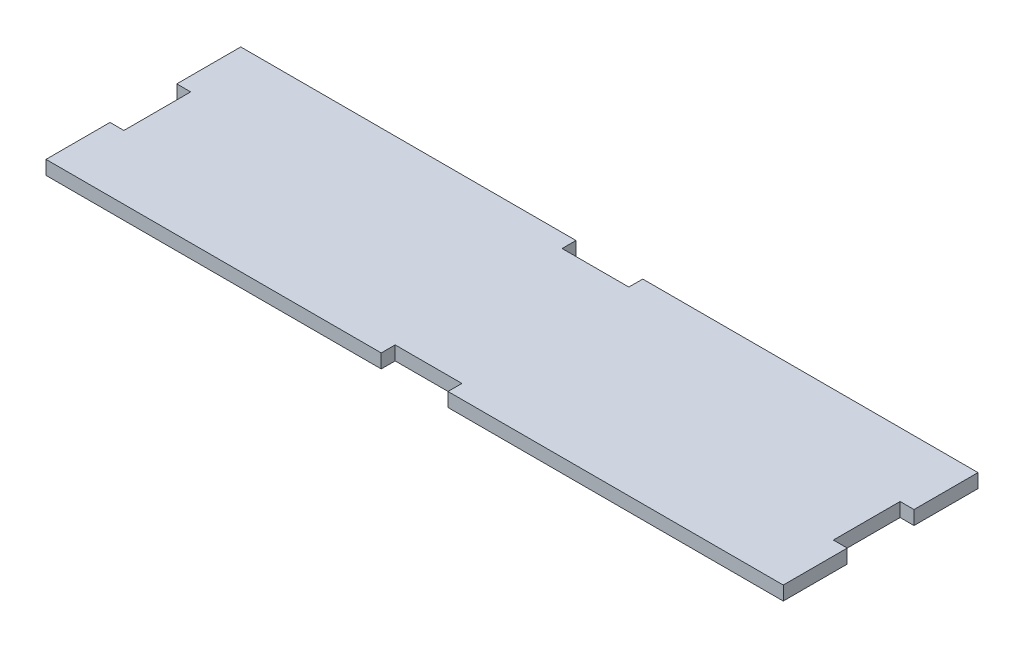
ISO-10303-21;
HEADER;
FILE_DESCRIPTION(('STEP AP214'),'2;1');
FILE_NAME('part.step','',(''),(''),'','','');
FILE_SCHEMA(('AUTOMOTIVE_DESIGN { 1 0 10303 214 1 1 1 1 }'));
ENDSEC;
DATA;
#1=APPLICATION_CONTEXT('core data for automotive mechanical design processes');
#2=APPLICATION_PROTOCOL_DEFINITION('international standard','automotive_design',2000,#1);
#3=PRODUCT_CONTEXT('',#1,'mechanical');
#4=PRODUCT('Part','Part','',(#3));
#5=PRODUCT_RELATED_PRODUCT_CATEGORY('part','',(#4));
#6=PRODUCT_DEFINITION_FORMATION('','',#4);
#7=PRODUCT_DEFINITION_CONTEXT('part definition',#1,'design');
#8=PRODUCT_DEFINITION('design','',#6,#7);
#9=PRODUCT_DEFINITION_SHAPE('','',#8);
#10=(LENGTH_UNIT() NAMED_UNIT(*) SI_UNIT(.MILLI.,.METRE.));
#11=(NAMED_UNIT(*) PLANE_ANGLE_UNIT() SI_UNIT($,.RADIAN.));
#12=(NAMED_UNIT(*) SI_UNIT($,.STERADIAN.) SOLID_ANGLE_UNIT());
#13=UNCERTAINTY_MEASURE_WITH_UNIT(LENGTH_MEASURE(1.E-05),#10,'distance_accuracy_value','');
#14=(GEOMETRIC_REPRESENTATION_CONTEXT(3) GLOBAL_UNCERTAINTY_ASSIGNED_CONTEXT((#13)) GLOBAL_UNIT_ASSIGNED_CONTEXT((#10,
#11,#12)) REPRESENTATION_CONTEXT('',''));
#15=CARTESIAN_POINT('',(0.,0.,0.));
#16=DIRECTION('',(0.,0.,1.));
#17=DIRECTION('',(1.,0.,0.));
#18=AXIS2_PLACEMENT_3D('',#15,#16,#17);
#19=CARTESIAN_POINT('',(0.,6.35,0.));
#20=DIRECTION('',(-1.,0.,0.));
#21=DIRECTION('',(0.,0.,1.));
#22=AXIS2_PLACEMENT_3D('',#19,#20,#21);
#23=PLANE('',#22);
#24=DIRECTION('',(0.,0.,-1.));
#25=VECTOR('',#24,1.);
#26=CARTESIAN_POINT('',(0.,0.,0.));
#27=LINE('',#26,#25);
#28=CARTESIAN_POINT('',(0.,0.,88.9));
#29=VERTEX_POINT('',#28);
#30=CARTESIAN_POINT('',(0.,0.,59.69));
#31=VERTEX_POINT('',#30);
#32=EDGE_CURVE('E350',#29,#31,#27,.T.);
#33=ORIENTED_EDGE('',*,*,#32,.T.);
#34=DIRECTION('',(0.,1.,0.));
#35=VECTOR('',#34,1.);
#36=CARTESIAN_POINT('',(0.,0.,59.69));
#37=LINE('',#36,#35);
#38=CARTESIAN_POINT('',(0.,6.35,59.69));
#39=VERTEX_POINT('',#38);
#40=EDGE_CURVE('E240',#31,#39,#37,.T.);
#41=ORIENTED_EDGE('',*,*,#40,.T.);
#42=DIRECTION('',(0.,0.,-1.));
#43=VECTOR('',#42,1.);
#44=CARTESIAN_POINT('',(0.,6.35,0.));
#45=LINE('',#44,#43);
#46=CARTESIAN_POINT('',(0.,6.35,88.9));
#47=VERTEX_POINT('',#46);
#48=EDGE_CURVE('E329',#47,#39,#45,.T.);
#49=ORIENTED_EDGE('',*,*,#48,.F.);
#50=DIRECTION('',(0.,-1.,0.));
#51=VECTOR('',#50,1.);
#52=CARTESIAN_POINT('',(0.,6.35,88.9));
#53=LINE('',#52,#51);
#54=EDGE_CURVE('E349',#47,#29,#53,.T.);
#55=ORIENTED_EDGE('',*,*,#54,.T.);
#56=EDGE_LOOP('',(#33,#41,#49,#55));
#57=FACE_BOUND('',#56,.T.);
#58=ADVANCED_FACE('F39',(#57),#23,.F.);
#59=CARTESIAN_POINT('',(0.,6.35,0.));
#60=DIRECTION('',(0.,0.,1.));
#61=DIRECTION('',(1.,0.,0.));
#62=AXIS2_PLACEMENT_3D('',#59,#60,#61);
#63=PLANE('',#62);
#64=DIRECTION('',(-1.,0.,0.));
#65=VECTOR('',#64,1.);
#66=CARTESIAN_POINT('',(0.,6.35,0.));
#67=LINE('',#66,#65);
#68=CARTESIAN_POINT('',(-183.515,6.35,0.));
#69=VERTEX_POINT('',#68);
#70=CARTESIAN_POINT('',(-336.55,6.35,0.));
#71=VERTEX_POINT('',#70);
#72=EDGE_CURVE('E333',#69,#71,#67,.T.);
#73=ORIENTED_EDGE('',*,*,#72,.F.);
#74=DIRECTION('',(0.,1.,0.));
#75=VECTOR('',#74,1.);
#76=CARTESIAN_POINT('',(-183.515,0.,0.));
#77=LINE('',#76,#75);
#78=CARTESIAN_POINT('',(-183.515,0.,0.));
#79=VERTEX_POINT('',#78);
#80=EDGE_CURVE('E214',#79,#69,#77,.T.);
#81=ORIENTED_EDGE('',*,*,#80,.F.);
#82=DIRECTION('',(-1.,0.,0.));
#83=VECTOR('',#82,1.);
#84=CARTESIAN_POINT('',(0.,0.,0.));
#85=LINE('',#84,#83);
#86=CARTESIAN_POINT('',(-336.55,0.,0.));
#87=VERTEX_POINT('',#86);
#88=EDGE_CURVE('E199',#79,#87,#85,.T.);
#89=ORIENTED_EDGE('',*,*,#88,.T.);
#90=DIRECTION('',(0.,-1.,0.));
#91=VECTOR('',#90,1.);
#92=CARTESIAN_POINT('',(-336.55,6.35,0.));
#93=LINE('',#92,#91);
#94=EDGE_CURVE('E48',#71,#87,#93,.T.);
#95=ORIENTED_EDGE('',*,*,#94,.F.);
#96=EDGE_LOOP('',(#73,#81,#89,#95));
#97=FACE_BOUND('',#96,.T.);
#98=ADVANCED_FACE('F461',(#97),#63,.F.);
#99=CARTESIAN_POINT('',(-336.55,6.35,0.));
#100=DIRECTION('',(1.,0.,0.));
#101=DIRECTION('',(0.,0.,-1.));
#102=AXIS2_PLACEMENT_3D('',#99,#100,#101);
#103=PLANE('',#102);
#104=DIRECTION('',(0.,0.,1.));
#105=VECTOR('',#104,1.);
#106=CARTESIAN_POINT('',(-336.55,0.,0.));
#107=LINE('',#106,#105);
#108=CARTESIAN_POINT('',(-336.55,0.,29.21));
#109=VERTEX_POINT('',#108);
#110=EDGE_CURVE('E359',#87,#109,#107,.T.);
#111=ORIENTED_EDGE('',*,*,#110,.T.);
#112=DIRECTION('',(0.,1.,0.));
#113=VECTOR('',#112,1.);
#114=CARTESIAN_POINT('',(-336.55,0.,29.21));
#115=LINE('',#114,#113);
#116=CARTESIAN_POINT('',(-336.55,6.35,29.21));
#117=VERTEX_POINT('',#116);
#118=EDGE_CURVE('E277',#109,#117,#115,.T.);
#119=ORIENTED_EDGE('',*,*,#118,.T.);
#120=DIRECTION('',(0.,0.,1.));
#121=VECTOR('',#120,1.);
#122=CARTESIAN_POINT('',(-336.55,6.35,0.));
#123=LINE('',#122,#121);
#124=EDGE_CURVE('E340',#71,#117,#123,.T.);
#125=ORIENTED_EDGE('',*,*,#124,.F.);
#126=ORIENTED_EDGE('',*,*,#94,.T.);
#127=EDGE_LOOP('',(#111,#119,#125,#126));
#128=FACE_BOUND('',#127,.T.);
#129=ADVANCED_FACE('F379',(#128),#103,.F.);
#130=CARTESIAN_POINT('',(0.,6.35,88.9));
#131=DIRECTION('',(0.,0.,-1.));
#132=DIRECTION('',(-1.,0.,0.));
#133=AXIS2_PLACEMENT_3D('',#130,#131,#132);
#134=PLANE('',#133);
#135=DIRECTION('',(1.,0.,0.));
#136=VECTOR('',#135,1.);
#137=CARTESIAN_POINT('',(0.,0.,88.9));
#138=LINE('',#137,#136);
#139=CARTESIAN_POINT('',(-336.55,0.,88.9));
#140=VERTEX_POINT('',#139);
#141=CARTESIAN_POINT('',(-183.515,0.,88.9));
#142=VERTEX_POINT('',#141);
#143=EDGE_CURVE('E364',#140,#142,#138,.T.);
#144=ORIENTED_EDGE('',*,*,#143,.T.);
#145=DIRECTION('',(0.,1.,0.));
#146=VECTOR('',#145,1.);
#147=CARTESIAN_POINT('',(-183.515,0.,88.9));
#148=LINE('',#147,#146);
#149=CARTESIAN_POINT('',(-183.515,6.35,88.9));
#150=VERTEX_POINT('',#149);
#151=EDGE_CURVE('E235',#142,#150,#148,.T.);
#152=ORIENTED_EDGE('',*,*,#151,.T.);
#153=DIRECTION('',(1.,0.,0.));
#154=VECTOR('',#153,1.);
#155=CARTESIAN_POINT('',(0.,6.35,88.9));
#156=LINE('',#155,#154);
#157=CARTESIAN_POINT('',(-336.55,6.35,88.9));
#158=VERTEX_POINT('',#157);
#159=EDGE_CURVE('E345',#158,#150,#156,.T.);
#160=ORIENTED_EDGE('',*,*,#159,.F.);
#161=DIRECTION('',(0.,-1.,0.));
#162=VECTOR('',#161,1.);
#163=CARTESIAN_POINT('',(-336.55,6.35,88.9));
#164=LINE('',#163,#162);
#165=EDGE_CURVE('E371',#158,#140,#164,.T.);
#166=ORIENTED_EDGE('',*,*,#165,.T.);
#167=EDGE_LOOP('',(#144,#152,#160,#166));
#168=FACE_BOUND('',#167,.T.);
#169=ADVANCED_FACE('F438',(#168),#134,.F.);
#170=CARTESIAN_POINT('',(0.,6.35,29.21));
#171=VERTEX_POINT('',#170);
#172=CARTESIAN_POINT('',(0.,6.35,0.));
#173=VERTEX_POINT('',#172);
#174=EDGE_CURVE('E334',#171,#173,#45,.T.);
#175=ORIENTED_EDGE('',*,*,#174,.F.);
#176=DIRECTION('',(0.,1.,0.));
#177=VECTOR('',#176,1.);
#178=CARTESIAN_POINT('',(0.,0.,29.21));
#179=LINE('',#178,#177);
#180=CARTESIAN_POINT('',(0.,0.,29.21));
#181=VERTEX_POINT('',#180);
#182=EDGE_CURVE('E271',#181,#171,#179,.T.);
#183=ORIENTED_EDGE('',*,*,#182,.F.);
#184=CARTESIAN_POINT('',(0.,0.,0.));
#185=VERTEX_POINT('',#184);
#186=EDGE_CURVE('E217',#181,#185,#27,.T.);
#187=ORIENTED_EDGE('',*,*,#186,.T.);
#188=DIRECTION('',(0.,-1.,0.));
#189=VECTOR('',#188,1.);
#190=CARTESIAN_POINT('',(0.,6.35,0.));
#191=LINE('',#190,#189);
#192=EDGE_CURVE('E11',#173,#185,#191,.T.);
#193=ORIENTED_EDGE('',*,*,#192,.F.);
#194=EDGE_LOOP('',(#175,#183,#187,#193));
#195=FACE_BOUND('',#194,.T.);
#196=ADVANCED_FACE('F41',(#195),#23,.F.);
#197=CARTESIAN_POINT('',(-153.035,0.,0.));
#198=VERTEX_POINT('',#197);
#199=EDGE_CURVE('E354',#185,#198,#85,.T.);
#200=ORIENTED_EDGE('',*,*,#199,.T.);
#201=DIRECTION('',(0.,1.,0.));
#202=VECTOR('',#201,1.);
#203=CARTESIAN_POINT('',(-153.035,0.,0.));
#204=LINE('',#203,#202);
#205=CARTESIAN_POINT('',(-153.035,6.35,0.));
#206=VERTEX_POINT('',#205);
#207=EDGE_CURVE('E218',#198,#206,#204,.T.);
#208=ORIENTED_EDGE('',*,*,#207,.T.);
#209=EDGE_CURVE('E335',#173,#206,#67,.T.);
#210=ORIENTED_EDGE('',*,*,#209,.F.);
#211=ORIENTED_EDGE('',*,*,#192,.T.);
#212=EDGE_LOOP('',(#200,#208,#210,#211));
#213=FACE_BOUND('',#212,.T.);
#214=ADVANCED_FACE('F404',(#213),#63,.F.);
#215=CARTESIAN_POINT('',(-336.55,6.35,59.69));
#216=VERTEX_POINT('',#215);
#217=EDGE_CURVE('E339',#216,#158,#123,.T.);
#218=ORIENTED_EDGE('',*,*,#217,.F.);
#219=DIRECTION('',(0.,1.,0.));
#220=VECTOR('',#219,1.);
#221=CARTESIAN_POINT('',(-336.55,0.,59.69));
#222=LINE('',#221,#220);
#223=CARTESIAN_POINT('',(-336.55,0.,59.69));
#224=VERTEX_POINT('',#223);
#225=EDGE_CURVE('E307',#224,#216,#222,.T.);
#226=ORIENTED_EDGE('',*,*,#225,.F.);
#227=EDGE_CURVE('E358',#224,#140,#107,.T.);
#228=ORIENTED_EDGE('',*,*,#227,.T.);
#229=ORIENTED_EDGE('',*,*,#165,.F.);
#230=EDGE_LOOP('',(#218,#226,#228,#229));
#231=FACE_BOUND('',#230,.T.);
#232=ADVANCED_FACE('F445',(#231),#103,.F.);
#233=CARTESIAN_POINT('',(-153.035,6.35,88.9));
#234=VERTEX_POINT('',#233);
#235=EDGE_CURVE('E344',#234,#47,#156,.T.);
#236=ORIENTED_EDGE('',*,*,#235,.F.);
#237=DIRECTION('',(0.,1.,0.));
#238=VECTOR('',#237,1.);
#239=CARTESIAN_POINT('',(-153.035,0.,88.9));
#240=LINE('',#239,#238);
#241=CARTESIAN_POINT('',(-153.035,0.,88.9));
#242=VERTEX_POINT('',#241);
#243=EDGE_CURVE('E252',#242,#234,#240,.T.);
#244=ORIENTED_EDGE('',*,*,#243,.F.);
#245=EDGE_CURVE('E363',#242,#29,#138,.T.);
#246=ORIENTED_EDGE('',*,*,#245,.T.);
#247=ORIENTED_EDGE('',*,*,#54,.F.);
#248=EDGE_LOOP('',(#236,#244,#246,#247));
#249=FACE_BOUND('',#248,.T.);
#250=ADVANCED_FACE('F427',(#249),#134,.F.);
#251=CARTESIAN_POINT('',(0.,6.35,0.));
#252=DIRECTION('',(0.,-1.,0.));
#253=DIRECTION('',(0.,0.,-1.));
#254=AXIS2_PLACEMENT_3D('',#251,#252,#253);
#255=PLANE('',#254);
#256=DIRECTION('',(1.,0.,0.));
#257=VECTOR('',#256,1.);
#258=CARTESIAN_POINT('',(-183.515,6.35,6.35000000000004));
#259=LINE('',#258,#257);
#260=CARTESIAN_POINT('',(-183.515,6.35,6.35000000000004));
#261=VERTEX_POINT('',#260);
#262=CARTESIAN_POINT('',(-153.035,6.35,6.35000000000003));
#263=VERTEX_POINT('',#262);
#264=EDGE_CURVE('E204',#261,#263,#259,.T.);
#265=ORIENTED_EDGE('',*,*,#264,.F.);
#266=DIRECTION('',(0.,0.,1.));
#267=VECTOR('',#266,1.);
#268=CARTESIAN_POINT('',(-183.515,6.35,0.));
#269=LINE('',#268,#267);
#270=EDGE_CURVE('E183',#69,#261,#269,.T.);
#271=ORIENTED_EDGE('',*,*,#270,.F.);
#272=ORIENTED_EDGE('',*,*,#72,.T.);
#273=ORIENTED_EDGE('',*,*,#124,.T.);
#274=DIRECTION('',(-1.,0.,0.));
#275=VECTOR('',#274,1.);
#276=CARTESIAN_POINT('',(-336.55,6.35,29.21));
#277=LINE('',#276,#275);
#278=CARTESIAN_POINT('',(-330.2,6.35,29.21));
#279=VERTEX_POINT('',#278);
#280=EDGE_CURVE('E299',#279,#117,#277,.T.);
#281=ORIENTED_EDGE('',*,*,#280,.F.);
#282=DIRECTION('',(0.,0.,-1.));
#283=VECTOR('',#282,1.);
#284=CARTESIAN_POINT('',(-330.2,6.35,29.21));
#285=LINE('',#284,#283);
#286=CARTESIAN_POINT('',(-330.2,6.35,59.69));
#287=VERTEX_POINT('',#286);
#288=EDGE_CURVE('E312',#287,#279,#285,.T.);
#289=ORIENTED_EDGE('',*,*,#288,.F.);
#290=DIRECTION('',(1.,0.,0.));
#291=VECTOR('',#290,1.);
#292=CARTESIAN_POINT('',(-336.55,6.35,59.69));
#293=LINE('',#292,#291);
#294=EDGE_CURVE('E308',#216,#287,#293,.T.);
#295=ORIENTED_EDGE('',*,*,#294,.F.);
#296=ORIENTED_EDGE('',*,*,#217,.T.);
#297=ORIENTED_EDGE('',*,*,#159,.T.);
#298=DIRECTION('',(0.,0.,1.));
#299=VECTOR('',#298,1.);
#300=CARTESIAN_POINT('',(-183.515,6.35,88.9));
#301=LINE('',#300,#299);
#302=CARTESIAN_POINT('',(-183.515,6.35,82.5500000000001));
#303=VERTEX_POINT('',#302);
#304=EDGE_CURVE('E236',#303,#150,#301,.T.);
#305=ORIENTED_EDGE('',*,*,#304,.F.);
#306=DIRECTION('',(-1.,0.,0.));
#307=VECTOR('',#306,1.);
#308=CARTESIAN_POINT('',(-183.515,6.35,82.5500000000001));
#309=LINE('',#308,#307);
#310=CARTESIAN_POINT('',(-153.035,6.35,82.55));
#311=VERTEX_POINT('',#310);
#312=EDGE_CURVE('E229',#311,#303,#309,.T.);
#313=ORIENTED_EDGE('',*,*,#312,.F.);
#314=DIRECTION('',(0.,0.,-1.));
#315=VECTOR('',#314,1.);
#316=CARTESIAN_POINT('',(-153.035,6.35,88.9));
#317=LINE('',#316,#315);
#318=EDGE_CURVE('E239',#234,#311,#317,.T.);
#319=ORIENTED_EDGE('',*,*,#318,.F.);
#320=ORIENTED_EDGE('',*,*,#235,.T.);
#321=ORIENTED_EDGE('',*,*,#48,.T.);
#322=DIRECTION('',(1.,0.,0.));
#323=VECTOR('',#322,1.);
#324=CARTESIAN_POINT('',(0.,6.35,59.69));
#325=LINE('',#324,#323);
#326=CARTESIAN_POINT('',(-6.35,6.35,59.69));
#327=VERTEX_POINT('',#326);
#328=EDGE_CURVE('E263',#327,#39,#325,.T.);
#329=ORIENTED_EDGE('',*,*,#328,.F.);
#330=DIRECTION('',(0.,0.,1.));
#331=VECTOR('',#330,1.);
#332=CARTESIAN_POINT('',(-6.35,6.35,59.69));
#333=LINE('',#332,#331);
#334=CARTESIAN_POINT('',(-6.35,6.35,29.21));
#335=VERTEX_POINT('',#334);
#336=EDGE_CURVE('E276',#335,#327,#333,.T.);
#337=ORIENTED_EDGE('',*,*,#336,.F.);
#338=DIRECTION('',(-1.,0.,0.));
#339=VECTOR('',#338,1.);
#340=CARTESIAN_POINT('',(0.,6.35,29.21));
#341=LINE('',#340,#339);
#342=EDGE_CURVE('E272',#171,#335,#341,.T.);
#343=ORIENTED_EDGE('',*,*,#342,.F.);
#344=ORIENTED_EDGE('',*,*,#174,.T.);
#345=ORIENTED_EDGE('',*,*,#209,.T.);
#346=DIRECTION('',(0.,0.,-1.));
#347=VECTOR('',#346,1.);
#348=CARTESIAN_POINT('',(-153.035,6.35,0.));
#349=LINE('',#348,#347);
#350=EDGE_CURVE('E201',#263,#206,#349,.T.);
#351=ORIENTED_EDGE('',*,*,#350,.F.);
#352=EDGE_LOOP('',(#265,#271,#272,#273,#281,#289,#295,#296,#297,#305,#313,#319,#320,#321,#329,
#337,#343,#344,#345,#351));
#353=FACE_BOUND('',#352,.T.);
#354=ADVANCED_FACE('F387',(#353),#255,.F.);
#355=CARTESIAN_POINT('',(0.,0.,0.));
#356=DIRECTION('',(0.,-1.,0.));
#357=DIRECTION('',(0.,0.,-1.));
#358=AXIS2_PLACEMENT_3D('',#355,#356,#357);
#359=PLANE('',#358);
#360=DIRECTION('',(0.,0.,1.));
#361=VECTOR('',#360,1.);
#362=CARTESIAN_POINT('',(-183.515,0.,0.));
#363=LINE('',#362,#361);
#364=CARTESIAN_POINT('',(-183.515,0.,6.35000000000004));
#365=VERTEX_POINT('',#364);
#366=EDGE_CURVE('E180',#79,#365,#363,.T.);
#367=ORIENTED_EDGE('',*,*,#366,.T.);
#368=DIRECTION('',(1.,0.,0.));
#369=VECTOR('',#368,1.);
#370=CARTESIAN_POINT('',(-183.515,0.,6.35000000000004));
#371=LINE('',#370,#369);
#372=CARTESIAN_POINT('',(-153.035,0.,6.35000000000003));
#373=VERTEX_POINT('',#372);
#374=EDGE_CURVE('E191',#365,#373,#371,.T.);
#375=ORIENTED_EDGE('',*,*,#374,.T.);
#376=DIRECTION('',(0.,0.,-1.));
#377=VECTOR('',#376,1.);
#378=CARTESIAN_POINT('',(-153.035,0.,0.));
#379=LINE('',#378,#377);
#380=EDGE_CURVE('E55',#373,#198,#379,.T.);
#381=ORIENTED_EDGE('',*,*,#380,.T.);
#382=ORIENTED_EDGE('',*,*,#199,.F.);
#383=ORIENTED_EDGE('',*,*,#186,.F.);
#384=DIRECTION('',(-1.,0.,0.));
#385=VECTOR('',#384,1.);
#386=CARTESIAN_POINT('',(0.,0.,29.21));
#387=LINE('',#386,#385);
#388=CARTESIAN_POINT('',(-6.35,0.,29.21));
#389=VERTEX_POINT('',#388);
#390=EDGE_CURVE('E258',#181,#389,#387,.T.);
#391=ORIENTED_EDGE('',*,*,#390,.T.);
#392=DIRECTION('',(0.,0.,1.));
#393=VECTOR('',#392,1.);
#394=CARTESIAN_POINT('',(-6.35,0.,59.69));
#395=LINE('',#394,#393);
#396=CARTESIAN_POINT('',(-6.35,0.,59.69));
#397=VERTEX_POINT('',#396);
#398=EDGE_CURVE('E262',#389,#397,#395,.T.);
#399=ORIENTED_EDGE('',*,*,#398,.T.);
#400=DIRECTION('',(1.,0.,0.));
#401=VECTOR('',#400,1.);
#402=CARTESIAN_POINT('',(0.,0.,59.69));
#403=LINE('',#402,#401);
#404=EDGE_CURVE('E267',#397,#31,#403,.T.);
#405=ORIENTED_EDGE('',*,*,#404,.T.);
#406=ORIENTED_EDGE('',*,*,#32,.F.);
#407=ORIENTED_EDGE('',*,*,#245,.F.);
#408=DIRECTION('',(0.,0.,-1.));
#409=VECTOR('',#408,1.);
#410=CARTESIAN_POINT('',(-153.035,0.,88.9));
#411=LINE('',#410,#409);
#412=CARTESIAN_POINT('',(-153.035,0.,82.55));
#413=VERTEX_POINT('',#412);
#414=EDGE_CURVE('E228',#242,#413,#411,.T.);
#415=ORIENTED_EDGE('',*,*,#414,.T.);
#416=DIRECTION('',(-1.,0.,0.));
#417=VECTOR('',#416,1.);
#418=CARTESIAN_POINT('',(-183.515,0.,82.5500000000001));
#419=LINE('',#418,#417);
#420=CARTESIAN_POINT('',(-183.515,0.,82.5500000000001));
#421=VERTEX_POINT('',#420);
#422=EDGE_CURVE('E63',#413,#421,#419,.T.);
#423=ORIENTED_EDGE('',*,*,#422,.T.);
#424=DIRECTION('',(0.,0.,1.));
#425=VECTOR('',#424,1.);
#426=CARTESIAN_POINT('',(-183.515,0.,88.9));
#427=LINE('',#426,#425);
#428=EDGE_CURVE('E224',#421,#142,#427,.T.);
#429=ORIENTED_EDGE('',*,*,#428,.T.);
#430=ORIENTED_EDGE('',*,*,#143,.F.);
#431=ORIENTED_EDGE('',*,*,#227,.F.);
#432=DIRECTION('',(1.,0.,0.));
#433=VECTOR('',#432,1.);
#434=CARTESIAN_POINT('',(-336.55,0.,59.69));
#435=LINE('',#434,#433);
#436=CARTESIAN_POINT('',(-330.2,0.,59.69));
#437=VERTEX_POINT('',#436);
#438=EDGE_CURVE('E294',#224,#437,#435,.T.);
#439=ORIENTED_EDGE('',*,*,#438,.T.);
#440=DIRECTION('',(0.,0.,-1.));
#441=VECTOR('',#440,1.);
#442=CARTESIAN_POINT('',(-330.2,0.,29.21));
#443=LINE('',#442,#441);
#444=CARTESIAN_POINT('',(-330.2,0.,29.21));
#445=VERTEX_POINT('',#444);
#446=EDGE_CURVE('E298',#437,#445,#443,.T.);
#447=ORIENTED_EDGE('',*,*,#446,.T.);
#448=DIRECTION('',(-1.,0.,0.));
#449=VECTOR('',#448,1.);
#450=CARTESIAN_POINT('',(-336.55,0.,29.21));
#451=LINE('',#450,#449);
#452=EDGE_CURVE('E303',#445,#109,#451,.T.);
#453=ORIENTED_EDGE('',*,*,#452,.T.);
#454=ORIENTED_EDGE('',*,*,#110,.F.);
#455=ORIENTED_EDGE('',*,*,#88,.F.);
#456=EDGE_LOOP('',(#367,#375,#381,#382,#383,#391,#399,#405,#406,#407,#415,#423,#429,#430,#431,
#439,#447,#453,#454,#455));
#457=FACE_BOUND('',#456,.T.);
#458=ADVANCED_FACE('F197',(#457),#359,.T.);
#459=CARTESIAN_POINT('',(-336.55,0.,29.21));
#460=DIRECTION('',(0.,0.,-1.));
#461=DIRECTION('',(-1.,0.,0.));
#462=AXIS2_PLACEMENT_3D('',#459,#460,#461);
#463=PLANE('',#462);
#464=ORIENTED_EDGE('',*,*,#280,.T.);
#465=ORIENTED_EDGE('',*,*,#118,.F.);
#466=ORIENTED_EDGE('',*,*,#452,.F.);
#467=DIRECTION('',(0.,1.,0.));
#468=VECTOR('',#467,1.);
#469=CARTESIAN_POINT('',(-330.2,0.,29.21));
#470=LINE('',#469,#468);
#471=EDGE_CURVE('E321',#445,#279,#470,.T.);
#472=ORIENTED_EDGE('',*,*,#471,.T.);
#473=EDGE_LOOP('',(#464,#465,#466,#472));
#474=FACE_BOUND('',#473,.T.);
#475=ADVANCED_FACE('F384',(#474),#463,.F.);
#476=CARTESIAN_POINT('',(-330.2,0.,29.21));
#477=DIRECTION('',(1.,0.,0.));
#478=DIRECTION('',(0.,0.,-1.));
#479=AXIS2_PLACEMENT_3D('',#476,#477,#478);
#480=PLANE('',#479);
#481=ORIENTED_EDGE('',*,*,#288,.T.);
#482=ORIENTED_EDGE('',*,*,#471,.F.);
#483=ORIENTED_EDGE('',*,*,#446,.F.);
#484=DIRECTION('',(0.,1.,0.));
#485=VECTOR('',#484,1.);
#486=CARTESIAN_POINT('',(-330.2,0.,59.69));
#487=LINE('',#486,#485);
#488=EDGE_CURVE('E324',#437,#287,#487,.T.);
#489=ORIENTED_EDGE('',*,*,#488,.T.);
#490=EDGE_LOOP('',(#481,#482,#483,#489));
#491=FACE_BOUND('',#490,.T.);
#492=ADVANCED_FACE('F451',(#491),#480,.F.);
#493=CARTESIAN_POINT('',(-336.55,0.,59.69));
#494=DIRECTION('',(0.,0.,1.));
#495=DIRECTION('',(1.,0.,0.));
#496=AXIS2_PLACEMENT_3D('',#493,#494,#495);
#497=PLANE('',#496);
#498=ORIENTED_EDGE('',*,*,#294,.T.);
#499=ORIENTED_EDGE('',*,*,#488,.F.);
#500=ORIENTED_EDGE('',*,*,#438,.F.);
#501=ORIENTED_EDGE('',*,*,#225,.T.);
#502=EDGE_LOOP('',(#498,#499,#500,#501));
#503=FACE_BOUND('',#502,.T.);
#504=ADVANCED_FACE('F448',(#503),#497,.F.);
#505=CARTESIAN_POINT('',(0.,0.,59.69));
#506=DIRECTION('',(0.,0.,1.));
#507=DIRECTION('',(1.,0.,0.));
#508=AXIS2_PLACEMENT_3D('',#505,#506,#507);
#509=PLANE('',#508);
#510=ORIENTED_EDGE('',*,*,#328,.T.);
#511=ORIENTED_EDGE('',*,*,#40,.F.);
#512=ORIENTED_EDGE('',*,*,#404,.F.);
#513=DIRECTION('',(0.,1.,0.));
#514=VECTOR('',#513,1.);
#515=CARTESIAN_POINT('',(-6.35,0.,59.69));
#516=LINE('',#515,#514);
#517=EDGE_CURVE('E286',#397,#327,#516,.T.);
#518=ORIENTED_EDGE('',*,*,#517,.T.);
#519=EDGE_LOOP('',(#510,#511,#512,#518));
#520=FACE_BOUND('',#519,.T.);
#521=ADVANCED_FACE('F417',(#520),#509,.F.);
#522=CARTESIAN_POINT('',(-6.35,0.,59.69));
#523=DIRECTION('',(-1.,0.,0.));
#524=DIRECTION('',(0.,0.,1.));
#525=AXIS2_PLACEMENT_3D('',#522,#523,#524);
#526=PLANE('',#525);
#527=ORIENTED_EDGE('',*,*,#336,.T.);
#528=ORIENTED_EDGE('',*,*,#517,.F.);
#529=ORIENTED_EDGE('',*,*,#398,.F.);
#530=DIRECTION('',(0.,1.,0.));
#531=VECTOR('',#530,1.);
#532=CARTESIAN_POINT('',(-6.35,0.,29.21));
#533=LINE('',#532,#531);
#534=EDGE_CURVE('E289',#389,#335,#533,.T.);
#535=ORIENTED_EDGE('',*,*,#534,.T.);
#536=EDGE_LOOP('',(#527,#528,#529,#535));
#537=FACE_BOUND('',#536,.T.);
#538=ADVANCED_FACE('F415',(#537),#526,.F.);
#539=CARTESIAN_POINT('',(0.,0.,29.21));
#540=DIRECTION('',(0.,0.,-1.));
#541=DIRECTION('',(-1.,0.,0.));
#542=AXIS2_PLACEMENT_3D('',#539,#540,#541);
#543=PLANE('',#542);
#544=ORIENTED_EDGE('',*,*,#342,.T.);
#545=ORIENTED_EDGE('',*,*,#534,.F.);
#546=ORIENTED_EDGE('',*,*,#390,.F.);
#547=ORIENTED_EDGE('',*,*,#182,.T.);
#548=EDGE_LOOP('',(#544,#545,#546,#547));
#549=FACE_BOUND('',#548,.T.);
#550=ADVANCED_FACE('F411',(#549),#543,.F.);
#551=CARTESIAN_POINT('',(-183.515,0.,88.9));
#552=DIRECTION('',(-1.,0.,0.));
#553=DIRECTION('',(0.,0.,1.));
#554=AXIS2_PLACEMENT_3D('',#551,#552,#553);
#555=PLANE('',#554);
#556=ORIENTED_EDGE('',*,*,#304,.T.);
#557=ORIENTED_EDGE('',*,*,#151,.F.);
#558=ORIENTED_EDGE('',*,*,#428,.F.);
#559=DIRECTION('',(0.,1.,0.));
#560=VECTOR('',#559,1.);
#561=CARTESIAN_POINT('',(-183.515,0.,82.5500000000001));
#562=LINE('',#561,#560);
#563=EDGE_CURVE('E211',#421,#303,#562,.T.);
#564=ORIENTED_EDGE('',*,*,#563,.T.);
#565=EDGE_LOOP('',(#556,#557,#558,#564));
#566=FACE_BOUND('',#565,.T.);
#567=ADVANCED_FACE('F436',(#566),#555,.F.);
#568=CARTESIAN_POINT('',(-183.515,0.,82.5500000000001));
#569=DIRECTION('',(0.,0.,-1.));
#570=DIRECTION('',(-1.,0.,0.));
#571=AXIS2_PLACEMENT_3D('',#568,#569,#570);
#572=PLANE('',#571);
#573=ORIENTED_EDGE('',*,*,#312,.T.);
#574=ORIENTED_EDGE('',*,*,#563,.F.);
#575=ORIENTED_EDGE('',*,*,#422,.F.);
#576=DIRECTION('',(0.,1.,0.));
#577=VECTOR('',#576,1.);
#578=CARTESIAN_POINT('',(-153.035,0.,82.55));
#579=LINE('',#578,#577);
#580=EDGE_CURVE('E249',#413,#311,#579,.T.);
#581=ORIENTED_EDGE('',*,*,#580,.T.);
#582=EDGE_LOOP('',(#573,#574,#575,#581));
#583=FACE_BOUND('',#582,.T.);
#584=ADVANCED_FACE('F431',(#583),#572,.F.);
#585=CARTESIAN_POINT('',(-153.035,0.,88.9));
#586=DIRECTION('',(1.,0.,0.));
#587=DIRECTION('',(0.,0.,-1.));
#588=AXIS2_PLACEMENT_3D('',#585,#586,#587);
#589=PLANE('',#588);
#590=ORIENTED_EDGE('',*,*,#318,.T.);
#591=ORIENTED_EDGE('',*,*,#580,.F.);
#592=ORIENTED_EDGE('',*,*,#414,.F.);
#593=ORIENTED_EDGE('',*,*,#243,.T.);
#594=EDGE_LOOP('',(#590,#591,#592,#593));
#595=FACE_BOUND('',#594,.T.);
#596=ADVANCED_FACE('F430',(#595),#589,.F.);
#597=CARTESIAN_POINT('',(-183.515,0.,0.));
#598=DIRECTION('',(-1.,0.,0.));
#599=DIRECTION('',(0.,0.,1.));
#600=AXIS2_PLACEMENT_3D('',#597,#598,#599);
#601=PLANE('',#600);
#602=ORIENTED_EDGE('',*,*,#270,.T.);
#603=DIRECTION('',(0.,1.,0.));
#604=VECTOR('',#603,1.);
#605=CARTESIAN_POINT('',(-183.515,0.,6.35000000000004));
#606=LINE('',#605,#604);
#607=EDGE_CURVE('E176',#365,#261,#606,.T.);
#608=ORIENTED_EDGE('',*,*,#607,.F.);
#609=ORIENTED_EDGE('',*,*,#366,.F.);
#610=ORIENTED_EDGE('',*,*,#80,.T.);
#611=EDGE_LOOP('',(#602,#608,#609,#610));
#612=FACE_BOUND('',#611,.T.);
#613=ADVANCED_FACE('F178',(#612),#601,.F.);
#614=CARTESIAN_POINT('',(-153.035,0.,0.));
#615=DIRECTION('',(1.,0.,0.));
#616=DIRECTION('',(0.,0.,-1.));
#617=AXIS2_PLACEMENT_3D('',#614,#615,#616);
#618=PLANE('',#617);
#619=ORIENTED_EDGE('',*,*,#350,.T.);
#620=ORIENTED_EDGE('',*,*,#207,.F.);
#621=ORIENTED_EDGE('',*,*,#380,.F.);
#622=DIRECTION('',(0.,1.,0.));
#623=VECTOR('',#622,1.);
#624=CARTESIAN_POINT('',(-153.035,0.,6.35000000000003));
#625=LINE('',#624,#623);
#626=EDGE_CURVE('E188',#373,#263,#625,.T.);
#627=ORIENTED_EDGE('',*,*,#626,.T.);
#628=EDGE_LOOP('',(#619,#620,#621,#627));
#629=FACE_BOUND('',#628,.T.);
#630=ADVANCED_FACE('F580',(#629),#618,.F.);
#631=CARTESIAN_POINT('',(-183.515,0.,6.35000000000004));
#632=DIRECTION('',(0.,0.,1.));
#633=DIRECTION('',(1.,0.,0.));
#634=AXIS2_PLACEMENT_3D('',#631,#632,#633);
#635=PLANE('',#634);
#636=ORIENTED_EDGE('',*,*,#264,.T.);
#637=ORIENTED_EDGE('',*,*,#626,.F.);
#638=ORIENTED_EDGE('',*,*,#374,.F.);
#639=ORIENTED_EDGE('',*,*,#607,.T.);
#640=EDGE_LOOP('',(#636,#637,#638,#639));
#641=FACE_BOUND('',#640,.T.);
#642=ADVANCED_FACE('F192',(#641),#635,.F.);
#643=CLOSED_SHELL('',(#58,#98,#129,#169,#196,#214,#232,#250,#354,#458,#475,#492,#504,#521,#538,
#550,#567,#584,#596,#613,#630,#642));
#644=MANIFOLD_SOLID_BREP('B2',#643);
#645=ADVANCED_BREP_SHAPE_REPRESENTATION('',(#18,#644),#14);
#646=SHAPE_DEFINITION_REPRESENTATION(#9,#645);
ENDSEC;
END-ISO-10303-21;
